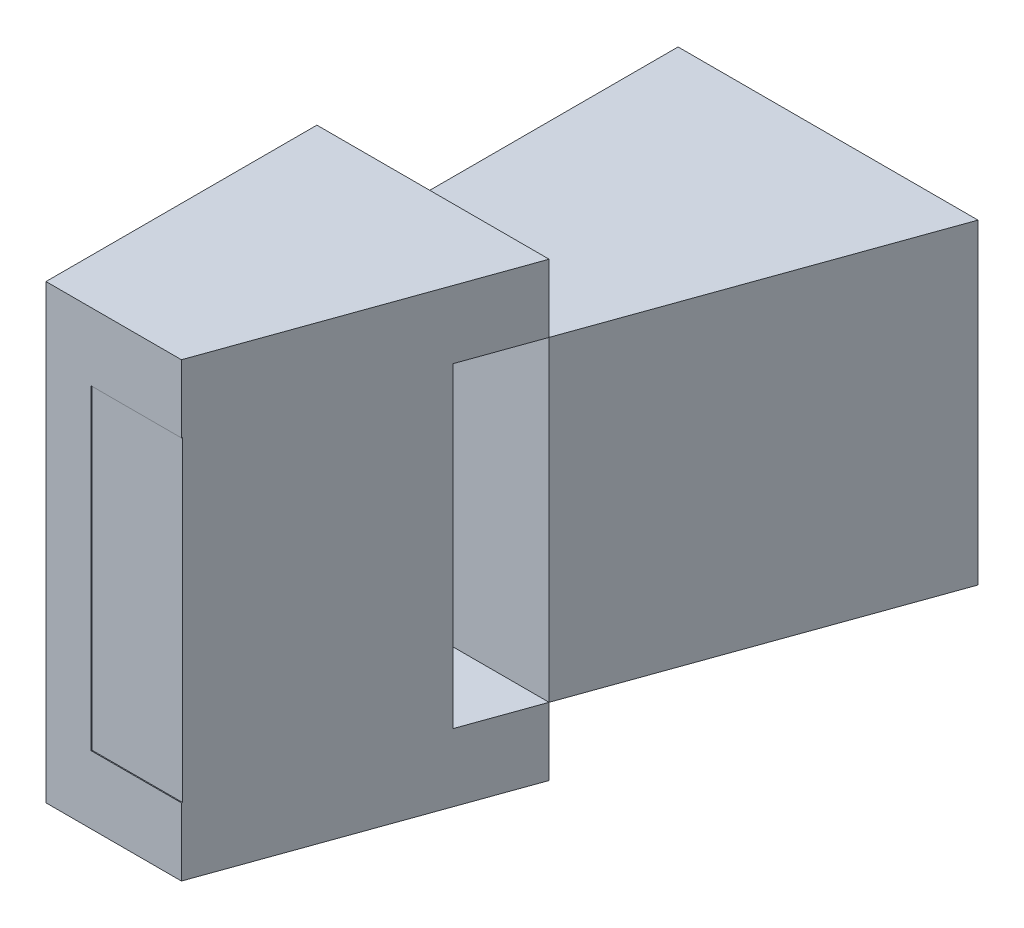
ISO-10303-21;
HEADER;
FILE_DESCRIPTION(('STEP AP214'),'2;1');
FILE_NAME('part.step','',(''),(''),'','','');
FILE_SCHEMA(('AUTOMOTIVE_DESIGN { 1 0 10303 214 1 1 1 1 }'));
ENDSEC;
DATA;
#1=APPLICATION_CONTEXT('core data for automotive mechanical design processes');
#2=APPLICATION_PROTOCOL_DEFINITION('international standard','automotive_design',2000,#1);
#3=PRODUCT_CONTEXT('',#1,'mechanical');
#4=PRODUCT('Part','Part','',(#3));
#5=PRODUCT_RELATED_PRODUCT_CATEGORY('part','',(#4));
#6=PRODUCT_DEFINITION_FORMATION('','',#4);
#7=PRODUCT_DEFINITION_CONTEXT('part definition',#1,'design');
#8=PRODUCT_DEFINITION('design','',#6,#7);
#9=PRODUCT_DEFINITION_SHAPE('','',#8);
#10=(LENGTH_UNIT() NAMED_UNIT(*) SI_UNIT(.MILLI.,.METRE.));
#11=(NAMED_UNIT(*) PLANE_ANGLE_UNIT() SI_UNIT($,.RADIAN.));
#12=(NAMED_UNIT(*) SI_UNIT($,.STERADIAN.) SOLID_ANGLE_UNIT());
#13=UNCERTAINTY_MEASURE_WITH_UNIT(LENGTH_MEASURE(1.E-05),#10,'distance_accuracy_value','');
#14=(GEOMETRIC_REPRESENTATION_CONTEXT(3) GLOBAL_UNCERTAINTY_ASSIGNED_CONTEXT((#13)) GLOBAL_UNIT_ASSIGNED_CONTEXT((#10,
#11,#12)) REPRESENTATION_CONTEXT('',''));
#15=CARTESIAN_POINT('',(0.,0.,0.));
#16=DIRECTION('',(0.,0.,1.));
#17=DIRECTION('',(1.,0.,0.));
#18=AXIS2_PLACEMENT_3D('',#15,#16,#17);
#19=CARTESIAN_POINT('',(10.,-152.524288900158,-18.390092879257));
#20=DIRECTION('',(1.,0.,0.));
#21=DIRECTION('',(0.,0.,-1.));
#22=AXIS2_PLACEMENT_3D('',#19,#20,#21);
#23=PLANE('',#22);
#24=DIRECTION('',(0.,0.,-1.));
#25=VECTOR('',#24,1.);
#26=CARTESIAN_POINT('',(10.,-56.0216718266254,-18.390092879257));
#27=LINE('',#26,#25);
#28=CARTESIAN_POINT('',(10.,-56.0216718266254,-18.390092879257));
#29=VERTEX_POINT('',#28);
#30=CARTESIAN_POINT('',(10.,-56.0216718266254,-88.390092879257));
#31=VERTEX_POINT('',#30);
#32=EDGE_CURVE('E95',#29,#31,#27,.T.);
#33=ORIENTED_EDGE('',*,*,#32,.F.);
#34=DIRECTION('',(0.,1.,0.));
#35=VECTOR('',#34,1.);
#36=CARTESIAN_POINT('',(10.,-152.524288900158,-18.390092879257));
#37=LINE('',#36,#35);
#38=CARTESIAN_POINT('',(10.,13.9783281733746,-18.390092879257));
#39=VERTEX_POINT('',#38);
#40=EDGE_CURVE('E49',#29,#39,#37,.T.);
#41=ORIENTED_EDGE('',*,*,#40,.T.);
#42=DIRECTION('',(0.,0.,-1.));
#43=VECTOR('',#42,1.);
#44=CARTESIAN_POINT('',(10.,13.9783281733746,-18.390092879257));
#45=LINE('',#44,#43);
#46=CARTESIAN_POINT('',(10.,13.9783281733746,-88.390092879257));
#47=VERTEX_POINT('',#46);
#48=EDGE_CURVE('E93',#39,#47,#45,.T.);
#49=ORIENTED_EDGE('',*,*,#48,.T.);
#50=DIRECTION('',(0.,1.,0.));
#51=VECTOR('',#50,1.);
#52=CARTESIAN_POINT('',(10.,-152.524288900158,-88.390092879257));
#53=LINE('',#52,#51);
#54=EDGE_CURVE('E84',#31,#47,#53,.T.);
#55=ORIENTED_EDGE('',*,*,#54,.F.);
#56=EDGE_LOOP('',(#33,#41,#49,#55));
#57=FACE_BOUND('',#56,.T.);
#58=ADVANCED_FACE('F45',(#57),#23,.F.);
#59=CARTESIAN_POINT('',(10.,-152.524288900158,-88.390092879257));
#60=DIRECTION('',(0.,0.,1.));
#61=DIRECTION('',(0.,-1.,0.));
#62=AXIS2_PLACEMENT_3D('',#59,#60,#61);
#63=PLANE('',#62);
#64=DIRECTION('',(1.,0.,0.));
#65=VECTOR('',#64,1.);
#66=CARTESIAN_POINT('',(10.,-56.0216718266254,-88.390092879257));
#67=LINE('',#66,#65);
#68=CARTESIAN_POINT('',(76.4285714285714,-56.0216718266254,-88.390092879257));
#69=VERTEX_POINT('',#68);
#70=EDGE_CURVE('E54',#31,#69,#67,.T.);
#71=ORIENTED_EDGE('',*,*,#70,.F.);
#72=ORIENTED_EDGE('',*,*,#54,.T.);
#73=DIRECTION('',(1.,0.,0.));
#74=VECTOR('',#73,1.);
#75=CARTESIAN_POINT('',(10.,13.9783281733746,-88.390092879257));
#76=LINE('',#75,#74);
#77=CARTESIAN_POINT('',(76.4285714285714,13.9783281733746,-88.390092879257));
#78=VERTEX_POINT('',#77);
#79=EDGE_CURVE('E105',#47,#78,#76,.T.);
#80=ORIENTED_EDGE('',*,*,#79,.T.);
#81=DIRECTION('',(0.,1.,0.));
#82=VECTOR('',#81,1.);
#83=CARTESIAN_POINT('',(76.4285714285714,-152.524288900158,-88.390092879257));
#84=LINE('',#83,#82);
#85=EDGE_CURVE('E114',#69,#78,#84,.T.);
#86=ORIENTED_EDGE('',*,*,#85,.F.);
#87=EDGE_LOOP('',(#71,#72,#80,#86));
#88=FACE_BOUND('',#87,.T.);
#89=ADVANCED_FACE('F118',(#88),#63,.F.);
#90=CARTESIAN_POINT('',(51.4285714285714,-152.524288900158,-18.390092879257));
#91=DIRECTION('',(-0.941741911594837,0.,-0.336336396998156));
#92=DIRECTION('',(-0.336336396998156,0.,0.941741911594838));
#93=AXIS2_PLACEMENT_3D('',#90,#91,#92);
#94=PLANE('',#93);
#95=DIRECTION('',(-0.336336396998156,0.,0.941741911594838));
#96=VECTOR('',#95,1.);
#97=CARTESIAN_POINT('',(51.4285714285714,-56.0216718266254,-18.390092879257));
#98=LINE('',#97,#96);
#99=CARTESIAN_POINT('',(51.4285714285714,-56.0216718266254,-18.390092879257));
#100=VERTEX_POINT('',#99);
#101=EDGE_CURVE('E12',#69,#100,#98,.T.);
#102=ORIENTED_EDGE('',*,*,#101,.F.);
#103=ORIENTED_EDGE('',*,*,#85,.T.);
#104=DIRECTION('',(-0.336336396998156,0.,0.941741911594837));
#105=VECTOR('',#104,1.);
#106=CARTESIAN_POINT('',(51.4285714285714,13.9783281733746,-18.390092879257));
#107=LINE('',#106,#105);
#108=CARTESIAN_POINT('',(51.4285714285714,13.9783281733746,-18.390092879257));
#109=VERTEX_POINT('',#108);
#110=EDGE_CURVE('E115',#78,#109,#107,.T.);
#111=ORIENTED_EDGE('',*,*,#110,.T.);
#112=DIRECTION('',(0.,1.,0.));
#113=VECTOR('',#112,1.);
#114=CARTESIAN_POINT('',(51.4285714285714,-152.524288900158,-18.390092879257));
#115=LINE('',#114,#113);
#116=EDGE_CURVE('E67',#100,#109,#115,.T.);
#117=ORIENTED_EDGE('',*,*,#116,.F.);
#118=EDGE_LOOP('',(#102,#103,#111,#117));
#119=FACE_BOUND('',#118,.T.);
#120=ADVANCED_FACE('F117',(#119),#94,.F.);
#121=CARTESIAN_POINT('',(10.,-152.524288900158,-18.390092879257));
#122=DIRECTION('',(0.,0.,-1.));
#123=DIRECTION('',(0.,1.,0.));
#124=AXIS2_PLACEMENT_3D('',#121,#122,#123);
#125=PLANE('',#124);
#126=DIRECTION('',(-1.,0.,0.));
#127=VECTOR('',#126,1.);
#128=CARTESIAN_POINT('',(10.,-56.0216718266254,-18.390092879257));
#129=LINE('',#128,#127);
#130=EDGE_CURVE('E102',#100,#29,#129,.T.);
#131=ORIENTED_EDGE('',*,*,#130,.F.);
#132=ORIENTED_EDGE('',*,*,#116,.T.);
#133=DIRECTION('',(-1.,0.,0.));
#134=VECTOR('',#133,1.);
#135=CARTESIAN_POINT('',(10.,13.9783281733746,-18.390092879257));
#136=LINE('',#135,#134);
#137=EDGE_CURVE('E98',#109,#39,#136,.T.);
#138=ORIENTED_EDGE('',*,*,#137,.T.);
#139=ORIENTED_EDGE('',*,*,#40,.F.);
#140=EDGE_LOOP('',(#131,#132,#138,#139));
#141=FACE_BOUND('',#140,.T.);
#142=ADVANCED_FACE('F99',(#141),#125,.F.);
#143=CARTESIAN_POINT('',(0.,13.9783281733746,0.));
#144=DIRECTION('',(0.,-1.,0.));
#145=DIRECTION('',(0.,0.,-1.));
#146=AXIS2_PLACEMENT_3D('',#143,#144,#145);
#147=PLANE('',#146);
#148=ORIENTED_EDGE('',*,*,#48,.F.);
#149=ORIENTED_EDGE('',*,*,#137,.F.);
#150=ORIENTED_EDGE('',*,*,#110,.F.);
#151=ORIENTED_EDGE('',*,*,#79,.F.);
#152=EDGE_LOOP('',(#148,#149,#150,#151));
#153=FACE_BOUND('',#152,.T.);
#154=ADVANCED_FACE('F104',(#153),#147,.F.);
#155=CARTESIAN_POINT('',(80.,-56.0216718266254,41.609907120743));
#156=DIRECTION('',(0.,-1.,0.));
#157=DIRECTION('',(0.,0.,-1.));
#158=AXIS2_PLACEMENT_3D('',#155,#156,#157);
#159=PLANE('',#158);
#160=ORIENTED_EDGE('',*,*,#130,.T.);
#161=ORIENTED_EDGE('',*,*,#32,.T.);
#162=ORIENTED_EDGE('',*,*,#70,.T.);
#163=ORIENTED_EDGE('',*,*,#101,.T.);
#164=EDGE_LOOP('',(#160,#161,#162,#163));
#165=FACE_BOUND('',#164,.T.);
#166=ADVANCED_FACE('F47',(#165),#159,.T.);
#167=CLOSED_SHELL('',(#58,#89,#120,#142,#154,#166));
#168=MANIFOLD_SOLID_BREP('B2',#167);
#169=CARTESIAN_POINT('',(10.,0.,0.));
#170=DIRECTION('',(1.,0.,0.));
#171=DIRECTION('',(0.,0.,-1.));
#172=AXIS2_PLACEMENT_3D('',#169,#170,#171);
#173=PLANE('',#172);
#174=DIRECTION('',(0.,1.,0.));
#175=VECTOR('',#174,1.);
#176=CARTESIAN_POINT('',(10.,28.9783281733746,-18.390092879257));
#177=LINE('',#176,#175);
#178=CARTESIAN_POINT('',(10.,-56.0216718266254,-18.390092879257));
#179=VERTEX_POINT('',#178);
#180=CARTESIAN_POINT('',(10.,13.9783281733746,-18.390092879257));
#181=VERTEX_POINT('',#180);
#182=EDGE_CURVE('E272',#179,#181,#177,.T.);
#183=ORIENTED_EDGE('',*,*,#182,.T.);
#184=DIRECTION('',(0.,0.,-1.));
#185=VECTOR('',#184,1.);
#186=CARTESIAN_POINT('',(10.,13.9783281733746,41.609907120743));
#187=LINE('',#186,#185);
#188=CARTESIAN_POINT('',(10.,13.9783281733746,-2.7171027693953));
#189=VERTEX_POINT('',#188);
#190=EDGE_CURVE('E291',#189,#181,#187,.T.);
#191=ORIENTED_EDGE('',*,*,#190,.F.);
#192=DIRECTION('',(0.,1.,0.));
#193=VECTOR('',#192,1.);
#194=CARTESIAN_POINT('',(10.,-112.862524276234,-2.71710276939529));
#195=LINE('',#194,#193);
#196=CARTESIAN_POINT('',(10.,-56.0216718266254,-2.7171027693953));
#197=VERTEX_POINT('',#196);
#198=EDGE_CURVE('E318',#197,#189,#195,.T.);
#199=ORIENTED_EDGE('',*,*,#198,.F.);
#200=DIRECTION('',(0.,0.,1.));
#201=VECTOR('',#200,1.);
#202=CARTESIAN_POINT('',(10.,-56.0216718266254,41.609907120743));
#203=LINE('',#202,#201);
#204=EDGE_CURVE('E192',#179,#197,#203,.T.);
#205=ORIENTED_EDGE('',*,*,#204,.F.);
#206=EDGE_LOOP('',(#183,#191,#199,#205));
#207=FACE_BOUND('',#206,.T.);
#208=ADVANCED_FACE('F169',(#207),#173,.T.);
#209=DIRECTION('',(0.,1.,0.));
#210=VECTOR('',#209,1.);
#211=CARTESIAN_POINT('',(10.,-112.862524276234,41.4079079881589));
#212=LINE('',#211,#210);
#213=CARTESIAN_POINT('',(10.,-56.0216718266254,41.4079079881589));
#214=VERTEX_POINT('',#213);
#215=CARTESIAN_POINT('',(10.,13.9783281733746,41.4079079881589));
#216=VERTEX_POINT('',#215);
#217=EDGE_CURVE('E323',#214,#216,#212,.T.);
#218=ORIENTED_EDGE('',*,*,#217,.T.);
#219=CARTESIAN_POINT('',(10.,13.9783281733746,41.609907120743));
#220=VERTEX_POINT('',#219);
#221=EDGE_CURVE('E292',#220,#216,#187,.T.);
#222=ORIENTED_EDGE('',*,*,#221,.F.);
#223=DIRECTION('',(0.,-1.,0.));
#224=VECTOR('',#223,1.);
#225=CARTESIAN_POINT('',(10.,28.9783281733746,41.609907120743));
#226=LINE('',#225,#224);
#227=CARTESIAN_POINT('',(10.,-56.0216718266254,41.609907120743));
#228=VERTEX_POINT('',#227);
#229=EDGE_CURVE('E184',#220,#228,#226,.T.);
#230=ORIENTED_EDGE('',*,*,#229,.T.);
#231=EDGE_CURVE('E306',#214,#228,#203,.T.);
#232=ORIENTED_EDGE('',*,*,#231,.F.);
#233=EDGE_LOOP('',(#218,#222,#230,#232));
#234=FACE_BOUND('',#233,.T.);
#235=ADVANCED_FACE('F370',(#234),#173,.T.);
#236=CARTESIAN_POINT('',(10.,28.9783281733746,41.609907120743));
#237=DIRECTION('',(0.,0.,-1.));
#238=DIRECTION('',(0.,1.,0.));
#239=AXIS2_PLACEMENT_3D('',#236,#237,#238);
#240=PLANE('',#239);
#241=DIRECTION('',(0.,-1.,0.));
#242=VECTOR('',#241,1.);
#243=CARTESIAN_POINT('',(0.,28.9783281733746,41.609907120743));
#244=LINE('',#243,#242);
#245=CARTESIAN_POINT('',(0.,28.9783281733746,41.609907120743));
#246=VERTEX_POINT('',#245);
#247=CARTESIAN_POINT('',(0.,-71.0216718266254,41.609907120743));
#248=VERTEX_POINT('',#247);
#249=EDGE_CURVE('E334',#246,#248,#244,.T.);
#250=ORIENTED_EDGE('',*,*,#249,.T.);
#251=DIRECTION('',(-1.,0.,0.));
#252=VECTOR('',#251,1.);
#253=CARTESIAN_POINT('',(10.,-71.0216718266254,41.609907120743));
#254=LINE('',#253,#252);
#255=CARTESIAN_POINT('',(30.,-71.0216718266254,41.609907120743));
#256=VERTEX_POINT('',#255);
#257=EDGE_CURVE('E43',#256,#248,#254,.T.);
#258=ORIENTED_EDGE('',*,*,#257,.F.);
#259=DIRECTION('',(0.,-1.,0.));
#260=VECTOR('',#259,1.);
#261=CARTESIAN_POINT('',(30.,49.9783281733747,41.609907120743));
#262=LINE('',#261,#260);
#263=CARTESIAN_POINT('',(30.,-56.0216718266253,41.609907120743));
#264=VERTEX_POINT('',#263);
#265=EDGE_CURVE('E300',#264,#256,#262,.T.);
#266=ORIENTED_EDGE('',*,*,#265,.F.);
#267=DIRECTION('',(-1.,0.,0.));
#268=VECTOR('',#267,1.);
#269=CARTESIAN_POINT('',(80.,-56.0216718266254,41.609907120743));
#270=LINE('',#269,#268);
#271=EDGE_CURVE('E308',#264,#228,#270,.T.);
#272=ORIENTED_EDGE('',*,*,#271,.T.);
#273=ORIENTED_EDGE('',*,*,#229,.F.);
#274=DIRECTION('',(-1.,0.,0.));
#275=VECTOR('',#274,1.);
#276=CARTESIAN_POINT('',(80.,13.9783281733746,41.609907120743));
#277=LINE('',#276,#275);
#278=CARTESIAN_POINT('',(30.,13.9783281733746,41.609907120743));
#279=VERTEX_POINT('',#278);
#280=EDGE_CURVE('E283',#279,#220,#277,.T.);
#281=ORIENTED_EDGE('',*,*,#280,.F.);
#282=DIRECTION('',(0.,-1.,0.));
#283=VECTOR('',#282,1.);
#284=CARTESIAN_POINT('',(30.,49.9783281733747,41.609907120743));
#285=LINE('',#284,#283);
#286=CARTESIAN_POINT('',(30.,28.9783281733746,41.609907120743));
#287=VERTEX_POINT('',#286);
#288=EDGE_CURVE('E278',#287,#279,#285,.T.);
#289=ORIENTED_EDGE('',*,*,#288,.F.);
#290=DIRECTION('',(-1.,0.,0.));
#291=VECTOR('',#290,1.);
#292=CARTESIAN_POINT('',(10.,28.9783281733746,41.609907120743));
#293=LINE('',#292,#291);
#294=EDGE_CURVE('E260',#287,#246,#293,.T.);
#295=ORIENTED_EDGE('',*,*,#294,.T.);
#296=EDGE_LOOP('',(#250,#258,#266,#272,#273,#281,#289,#295));
#297=FACE_BOUND('',#296,.T.);
#298=ADVANCED_FACE('F171',(#297),#240,.F.);
#299=CARTESIAN_POINT('',(10.,-71.0216718266254,41.609907120743));
#300=DIRECTION('',(0.,1.,0.));
#301=DIRECTION('',(0.,0.,1.));
#302=AXIS2_PLACEMENT_3D('',#299,#300,#301);
#303=PLANE('',#302);
#304=DIRECTION('',(0.,0.,-1.));
#305=VECTOR('',#304,1.);
#306=CARTESIAN_POINT('',(0.,-71.0216718266254,41.609907120743));
#307=LINE('',#306,#305);
#308=CARTESIAN_POINT('',(0.,-71.0216718266254,-18.390092879257));
#309=VERTEX_POINT('',#308);
#310=EDGE_CURVE('E346',#248,#309,#307,.T.);
#311=ORIENTED_EDGE('',*,*,#310,.T.);
#312=DIRECTION('',(-1.,0.,0.));
#313=VECTOR('',#312,1.);
#314=CARTESIAN_POINT('',(10.,-71.0216718266254,-18.390092879257));
#315=LINE('',#314,#313);
#316=CARTESIAN_POINT('',(51.4285714285714,-71.0216718266254,-18.390092879257));
#317=VERTEX_POINT('',#316);
#318=EDGE_CURVE('E177',#317,#309,#315,.T.);
#319=ORIENTED_EDGE('',*,*,#318,.F.);
#320=DIRECTION('',(0.336336396998156,0.,-0.941741911594838));
#321=VECTOR('',#320,1.);
#322=CARTESIAN_POINT('',(30.,-71.0216718266254,41.609907120743));
#323=LINE('',#322,#321);
#324=EDGE_CURVE('E282',#256,#317,#323,.T.);
#325=ORIENTED_EDGE('',*,*,#324,.F.);
#326=ORIENTED_EDGE('',*,*,#257,.T.);
#327=EDGE_LOOP('',(#311,#319,#325,#326));
#328=FACE_BOUND('',#327,.T.);
#329=ADVANCED_FACE('F363',(#328),#303,.F.);
#330=CARTESIAN_POINT('',(10.,28.9783281733746,-18.390092879257));
#331=DIRECTION('',(0.,0.,1.));
#332=DIRECTION('',(0.,-1.,0.));
#333=AXIS2_PLACEMENT_3D('',#330,#331,#332);
#334=PLANE('',#333);
#335=DIRECTION('',(0.,1.,0.));
#336=VECTOR('',#335,1.);
#337=CARTESIAN_POINT('',(0.,28.9783281733746,-18.390092879257));
#338=LINE('',#337,#336);
#339=CARTESIAN_POINT('',(0.,28.9783281733746,-18.390092879257));
#340=VERTEX_POINT('',#339);
#341=EDGE_CURVE('E348',#309,#340,#338,.T.);
#342=ORIENTED_EDGE('',*,*,#341,.T.);
#343=DIRECTION('',(-1.,0.,0.));
#344=VECTOR('',#343,1.);
#345=CARTESIAN_POINT('',(10.,28.9783281733746,-18.390092879257));
#346=LINE('',#345,#344);
#347=CARTESIAN_POINT('',(51.4285714285714,28.9783281733746,-18.390092879257));
#348=VERTEX_POINT('',#347);
#349=EDGE_CURVE('E271',#348,#340,#346,.T.);
#350=ORIENTED_EDGE('',*,*,#349,.F.);
#351=DIRECTION('',(0.,-1.,0.));
#352=VECTOR('',#351,1.);
#353=CARTESIAN_POINT('',(51.4285714285714,28.9783281733746,-18.390092879257));
#354=LINE('',#353,#352);
#355=CARTESIAN_POINT('',(51.4285714285714,13.9783281733746,-18.390092879257));
#356=VERTEX_POINT('',#355);
#357=EDGE_CURVE('E281',#348,#356,#354,.T.);
#358=ORIENTED_EDGE('',*,*,#357,.T.);
#359=DIRECTION('',(-1.,0.,0.));
#360=VECTOR('',#359,1.);
#361=CARTESIAN_POINT('',(80.,13.9783281733746,-18.390092879257));
#362=LINE('',#361,#360);
#363=EDGE_CURVE('E294',#356,#181,#362,.T.);
#364=ORIENTED_EDGE('',*,*,#363,.T.);
#365=ORIENTED_EDGE('',*,*,#182,.F.);
#366=DIRECTION('',(-1.,0.,0.));
#367=VECTOR('',#366,1.);
#368=CARTESIAN_POINT('',(80.,-56.0216718266254,-18.390092879257));
#369=LINE('',#368,#367);
#370=CARTESIAN_POINT('',(51.4285714285714,-56.0216718266254,-18.390092879257));
#371=VERTEX_POINT('',#370);
#372=EDGE_CURVE('E311',#371,#179,#369,.T.);
#373=ORIENTED_EDGE('',*,*,#372,.F.);
#374=DIRECTION('',(0.,-1.,0.));
#375=VECTOR('',#374,1.);
#376=CARTESIAN_POINT('',(51.4285714285714,-71.0216718266254,-18.390092879257));
#377=LINE('',#376,#375);
#378=EDGE_CURVE('E303',#371,#317,#377,.T.);
#379=ORIENTED_EDGE('',*,*,#378,.T.);
#380=ORIENTED_EDGE('',*,*,#318,.T.);
#381=EDGE_LOOP('',(#342,#350,#358,#364,#365,#373,#379,#380));
#382=FACE_BOUND('',#381,.T.);
#383=ADVANCED_FACE('F354',(#382),#334,.F.);
#384=CARTESIAN_POINT('',(10.,28.9783281733746,41.609907120743));
#385=DIRECTION('',(0.,-1.,0.));
#386=DIRECTION('',(0.,0.,-1.));
#387=AXIS2_PLACEMENT_3D('',#384,#385,#386);
#388=PLANE('',#387);
#389=DIRECTION('',(0.,0.,1.));
#390=VECTOR('',#389,1.);
#391=CARTESIAN_POINT('',(0.,28.9783281733746,41.609907120743));
#392=LINE('',#391,#390);
#393=EDGE_CURVE('E266',#340,#246,#392,.T.);
#394=ORIENTED_EDGE('',*,*,#393,.T.);
#395=ORIENTED_EDGE('',*,*,#294,.F.);
#396=DIRECTION('',(0.336336396998156,0.,-0.941741911594837));
#397=VECTOR('',#396,1.);
#398=CARTESIAN_POINT('',(35.6561085972851,28.9783281733746,25.7728030483448));
#399=LINE('',#398,#397);
#400=EDGE_CURVE('E264',#287,#348,#399,.T.);
#401=ORIENTED_EDGE('',*,*,#400,.T.);
#402=ORIENTED_EDGE('',*,*,#349,.T.);
#403=EDGE_LOOP('',(#394,#395,#401,#402));
#404=FACE_BOUND('',#403,.T.);
#405=ADVANCED_FACE('F262',(#404),#388,.F.);
#406=CARTESIAN_POINT('',(0.,0.,0.));
#407=DIRECTION('',(1.,0.,0.));
#408=DIRECTION('',(0.,0.,-1.));
#409=AXIS2_PLACEMENT_3D('',#406,#407,#408);
#410=PLANE('',#409);
#411=ORIENTED_EDGE('',*,*,#249,.F.);
#412=ORIENTED_EDGE('',*,*,#393,.F.);
#413=ORIENTED_EDGE('',*,*,#341,.F.);
#414=ORIENTED_EDGE('',*,*,#310,.F.);
#415=EDGE_LOOP('',(#411,#412,#413,#414));
#416=FACE_BOUND('',#415,.T.);
#417=ADVANCED_FACE('F360',(#416),#410,.F.);
#418=CARTESIAN_POINT('',(0.,-112.862524276234,-2.71710276939529));
#419=DIRECTION('',(0.,0.,1.));
#420=DIRECTION('',(0.,-1.,0.));
#421=AXIS2_PLACEMENT_3D('',#418,#419,#420);
#422=PLANE('',#421);
#423=DIRECTION('',(1.,0.,0.));
#424=VECTOR('',#423,1.);
#425=CARTESIAN_POINT('',(0.,-56.0216718266254,-2.7171027693953));
#426=LINE('',#425,#424);
#427=CARTESIAN_POINT('',(45.8310749607637,-56.0216718266254,-2.71710276939529));
#428=VERTEX_POINT('',#427);
#429=EDGE_CURVE('E322',#197,#428,#426,.T.);
#430=ORIENTED_EDGE('',*,*,#429,.F.);
#431=ORIENTED_EDGE('',*,*,#198,.T.);
#432=DIRECTION('',(1.,0.,0.));
#433=VECTOR('',#432,1.);
#434=CARTESIAN_POINT('',(0.,13.9783281733746,-2.7171027693953));
#435=LINE('',#434,#433);
#436=CARTESIAN_POINT('',(45.8310749607637,13.9783281733746,-2.7171027693953));
#437=VERTEX_POINT('',#436);
#438=EDGE_CURVE('E324',#189,#437,#435,.T.);
#439=ORIENTED_EDGE('',*,*,#438,.T.);
#440=DIRECTION('',(0.,1.,0.));
#441=VECTOR('',#440,1.);
#442=CARTESIAN_POINT('',(45.8310749607637,-112.862524276234,-2.71710276939529));
#443=LINE('',#442,#441);
#444=EDGE_CURVE('E327',#428,#437,#443,.T.);
#445=ORIENTED_EDGE('',*,*,#444,.F.);
#446=EDGE_LOOP('',(#430,#431,#439,#445));
#447=FACE_BOUND('',#446,.T.);
#448=ADVANCED_FACE('F378',(#447),#422,.F.);
#449=CARTESIAN_POINT('',(39.7859434319096,-112.862524276234,14.2092655113963));
#450=DIRECTION('',(-0.941741911594838,0.,-0.336336396998156));
#451=DIRECTION('',(-0.336336396998156,0.,0.941741911594838));
#452=AXIS2_PLACEMENT_3D('',#449,#450,#451);
#453=PLANE('',#452);
#454=DIRECTION('',(0.,1.,0.));
#455=VECTOR('',#454,1.);
#456=CARTESIAN_POINT('',(30.0721425473515,-112.862524276234,41.4079079881589));
#457=LINE('',#456,#455);
#458=CARTESIAN_POINT('',(30.0721425473515,-56.0216718266254,41.4079079881589));
#459=VERTEX_POINT('',#458);
#460=CARTESIAN_POINT('',(30.0721425473515,13.9783281733746,41.4079079881589));
#461=VERTEX_POINT('',#460);
#462=EDGE_CURVE('E331',#459,#461,#457,.T.);
#463=ORIENTED_EDGE('',*,*,#462,.F.);
#464=DIRECTION('',(0.336336396998156,0.,-0.941741911594837));
#465=VECTOR('',#464,1.);
#466=CARTESIAN_POINT('',(35.6561085972851,-56.0216718266254,25.7728030483448));
#467=LINE('',#466,#465);
#468=EDGE_CURVE('E315',#264,#459,#467,.T.);
#469=ORIENTED_EDGE('',*,*,#468,.F.);
#470=ORIENTED_EDGE('',*,*,#265,.T.);
#471=ORIENTED_EDGE('',*,*,#324,.T.);
#472=ORIENTED_EDGE('',*,*,#378,.F.);
#473=EDGE_CURVE('E314',#428,#371,#467,.T.);
#474=ORIENTED_EDGE('',*,*,#473,.F.);
#475=ORIENTED_EDGE('',*,*,#444,.T.);
#476=DIRECTION('',(-0.336336396998156,0.,0.941741911594837));
#477=VECTOR('',#476,1.);
#478=CARTESIAN_POINT('',(35.6561085972851,13.9783281733746,25.7728030483448));
#479=LINE('',#478,#477);
#480=EDGE_CURVE('E289',#356,#437,#479,.T.);
#481=ORIENTED_EDGE('',*,*,#480,.F.);
#482=ORIENTED_EDGE('',*,*,#357,.F.);
#483=ORIENTED_EDGE('',*,*,#400,.F.);
#484=ORIENTED_EDGE('',*,*,#288,.T.);
#485=EDGE_CURVE('E286',#461,#279,#479,.T.);
#486=ORIENTED_EDGE('',*,*,#485,.F.);
#487=EDGE_LOOP('',(#463,#469,#470,#471,#472,#474,#475,#481,#482,#483,#484,#486));
#488=FACE_BOUND('',#487,.T.);
#489=ADVANCED_FACE('F277',(#488),#453,.F.);
#490=CARTESIAN_POINT('',(0.,-112.862524276234,41.4079079881589));
#491=DIRECTION('',(0.,0.,1.));
#492=DIRECTION('',(0.,-1.,0.));
#493=AXIS2_PLACEMENT_3D('',#490,#491,#492);
#494=PLANE('',#493);
#495=ORIENTED_EDGE('',*,*,#217,.F.);
#496=DIRECTION('',(1.,0.,0.));
#497=VECTOR('',#496,1.);
#498=CARTESIAN_POINT('',(0.,-56.0216718266254,41.4079079881589));
#499=LINE('',#498,#497);
#500=EDGE_CURVE('E328',#214,#459,#499,.T.);
#501=ORIENTED_EDGE('',*,*,#500,.T.);
#502=ORIENTED_EDGE('',*,*,#462,.T.);
#503=DIRECTION('',(1.,0.,0.));
#504=VECTOR('',#503,1.);
#505=CARTESIAN_POINT('',(0.,13.9783281733746,41.4079079881589));
#506=LINE('',#505,#504);
#507=EDGE_CURVE('E319',#216,#461,#506,.T.);
#508=ORIENTED_EDGE('',*,*,#507,.F.);
#509=EDGE_LOOP('',(#495,#501,#502,#508));
#510=FACE_BOUND('',#509,.T.);
#511=ADVANCED_FACE('F403',(#510),#494,.T.);
#512=CARTESIAN_POINT('',(80.,-56.0216718266254,41.609907120743));
#513=DIRECTION('',(0.,-1.,0.));
#514=DIRECTION('',(0.,0.,-1.));
#515=AXIS2_PLACEMENT_3D('',#512,#513,#514);
#516=PLANE('',#515);
#517=ORIENTED_EDGE('',*,*,#204,.T.);
#518=ORIENTED_EDGE('',*,*,#429,.T.);
#519=ORIENTED_EDGE('',*,*,#473,.T.);
#520=ORIENTED_EDGE('',*,*,#372,.T.);
#521=EDGE_LOOP('',(#517,#518,#519,#520));
#522=FACE_BOUND('',#521,.T.);
#523=ADVANCED_FACE('F409',(#522),#516,.F.);
#524=ORIENTED_EDGE('',*,*,#500,.F.);
#525=ORIENTED_EDGE('',*,*,#231,.T.);
#526=ORIENTED_EDGE('',*,*,#271,.F.);
#527=ORIENTED_EDGE('',*,*,#468,.T.);
#528=EDGE_LOOP('',(#524,#525,#526,#527));
#529=FACE_BOUND('',#528,.T.);
#530=ADVANCED_FACE('F417',(#529),#516,.F.);
#531=CARTESIAN_POINT('',(80.,13.9783281733746,41.609907120743));
#532=DIRECTION('',(0.,1.,0.));
#533=DIRECTION('',(0.,0.,1.));
#534=AXIS2_PLACEMENT_3D('',#531,#532,#533);
#535=PLANE('',#534);
#536=ORIENTED_EDGE('',*,*,#480,.T.);
#537=ORIENTED_EDGE('',*,*,#438,.F.);
#538=ORIENTED_EDGE('',*,*,#190,.T.);
#539=ORIENTED_EDGE('',*,*,#363,.F.);
#540=EDGE_LOOP('',(#536,#537,#538,#539));
#541=FACE_BOUND('',#540,.T.);
#542=ADVANCED_FACE('F425',(#541),#535,.F.);
#543=ORIENTED_EDGE('',*,*,#507,.T.);
#544=ORIENTED_EDGE('',*,*,#485,.T.);
#545=ORIENTED_EDGE('',*,*,#280,.T.);
#546=ORIENTED_EDGE('',*,*,#221,.T.);
#547=EDGE_LOOP('',(#543,#544,#545,#546));
#548=FACE_BOUND('',#547,.T.);
#549=ADVANCED_FACE('F432',(#548),#535,.F.);
#550=CLOSED_SHELL('',(#208,#235,#298,#329,#383,#405,#417,#448,#489,#511,#523,#530,#542,#549));
#551=MANIFOLD_SOLID_BREP('B6',#550);
#552=ADVANCED_BREP_SHAPE_REPRESENTATION('',(#18,#168,#551),#14);
#553=SHAPE_DEFINITION_REPRESENTATION(#9,#552);
ENDSEC;
END-ISO-10303-21;
